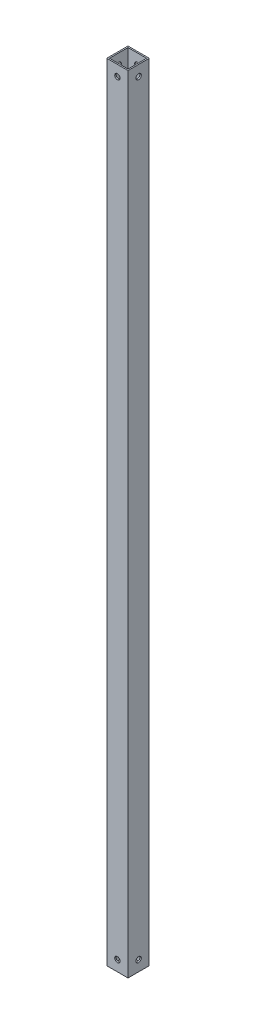
ISO-10303-21;
HEADER;
FILE_DESCRIPTION(('STEP AP214'),'2;1');
FILE_NAME('part.step','',(''),(''),'','','');
FILE_SCHEMA(('AUTOMOTIVE_DESIGN { 1 0 10303 214 1 1 1 1 }'));
ENDSEC;
DATA;
#1=APPLICATION_CONTEXT('core data for automotive mechanical design processes');
#2=APPLICATION_PROTOCOL_DEFINITION('international standard','automotive_design',2000,#1);
#3=PRODUCT_CONTEXT('',#1,'mechanical');
#4=PRODUCT('Part','Part','',(#3));
#5=PRODUCT_RELATED_PRODUCT_CATEGORY('part','',(#4));
#6=PRODUCT_DEFINITION_FORMATION('','',#4);
#7=PRODUCT_DEFINITION_CONTEXT('part definition',#1,'design');
#8=PRODUCT_DEFINITION('design','',#6,#7);
#9=PRODUCT_DEFINITION_SHAPE('','',#8);
#10=(LENGTH_UNIT() NAMED_UNIT(*) SI_UNIT(.MILLI.,.METRE.));
#11=(NAMED_UNIT(*) PLANE_ANGLE_UNIT() SI_UNIT($,.RADIAN.));
#12=(NAMED_UNIT(*) SI_UNIT($,.STERADIAN.) SOLID_ANGLE_UNIT());
#13=UNCERTAINTY_MEASURE_WITH_UNIT(LENGTH_MEASURE(1.E-05),#10,'distance_accuracy_value','');
#14=(GEOMETRIC_REPRESENTATION_CONTEXT(3) GLOBAL_UNCERTAINTY_ASSIGNED_CONTEXT((#13)) GLOBAL_UNIT_ASSIGNED_CONTEXT((#10,
#11,#12)) REPRESENTATION_CONTEXT('',''));
#15=CARTESIAN_POINT('',(0.,0.,0.));
#16=DIRECTION('',(0.,0.,1.));
#17=DIRECTION('',(1.,0.,0.));
#18=AXIS2_PLACEMENT_3D('',#15,#16,#17);
#19=CARTESIAN_POINT('',(0.,939.8,0.));
#20=DIRECTION('',(0.,1.,0.));
#21=DIRECTION('',(0.,0.,1.));
#22=AXIS2_PLACEMENT_3D('',#19,#20,#21);
#23=PLANE('',#22);
#24=DIRECTION('',(0.,0.,-1.));
#25=VECTOR('',#24,1.);
#26=CARTESIAN_POINT('',(12.7,939.8,-12.7));
#27=LINE('',#26,#25);
#28=CARTESIAN_POINT('',(12.7,939.8,12.7));
#29=VERTEX_POINT('',#28);
#30=CARTESIAN_POINT('',(12.7,939.8,-12.7));
#31=VERTEX_POINT('',#30);
#32=EDGE_CURVE('E157',#29,#31,#27,.T.);
#33=ORIENTED_EDGE('',*,*,#32,.T.);
#34=DIRECTION('',(-1.,0.,0.));
#35=VECTOR('',#34,1.);
#36=CARTESIAN_POINT('',(-12.7,939.8,-12.7));
#37=LINE('',#36,#35);
#38=CARTESIAN_POINT('',(-12.7,939.8,-12.7));
#39=VERTEX_POINT('',#38);
#40=EDGE_CURVE('E161',#31,#39,#37,.T.);
#41=ORIENTED_EDGE('',*,*,#40,.T.);
#42=DIRECTION('',(0.,0.,1.));
#43=VECTOR('',#42,1.);
#44=CARTESIAN_POINT('',(-12.7,939.8,-12.7));
#45=LINE('',#44,#43);
#46=CARTESIAN_POINT('',(-12.7,939.8,12.7));
#47=VERTEX_POINT('',#46);
#48=EDGE_CURVE('E165',#39,#47,#45,.T.);
#49=ORIENTED_EDGE('',*,*,#48,.T.);
#50=DIRECTION('',(1.,0.,0.));
#51=VECTOR('',#50,1.);
#52=CARTESIAN_POINT('',(-12.7,939.8,12.7));
#53=LINE('',#52,#51);
#54=EDGE_CURVE('E168',#47,#29,#53,.T.);
#55=ORIENTED_EDGE('',*,*,#54,.T.);
#56=EDGE_LOOP('',(#33,#41,#49,#55));
#57=FACE_BOUND('',#56,.T.);
#58=DIRECTION('',(1.,0.,0.));
#59=VECTOR('',#58,1.);
#60=CARTESIAN_POINT('',(-11.1125,939.8,11.1125));
#61=LINE('',#60,#59);
#62=CARTESIAN_POINT('',(-11.1125,939.8,11.1125));
#63=VERTEX_POINT('',#62);
#64=CARTESIAN_POINT('',(11.1125,939.8,11.1125));
#65=VERTEX_POINT('',#64);
#66=EDGE_CURVE('E116',#63,#65,#61,.T.);
#67=ORIENTED_EDGE('',*,*,#66,.F.);
#68=DIRECTION('',(0.,0.,1.));
#69=VECTOR('',#68,1.);
#70=CARTESIAN_POINT('',(-11.1125,939.8,-11.1125));
#71=LINE('',#70,#69);
#72=CARTESIAN_POINT('',(-11.1125,939.8,-11.1125));
#73=VERTEX_POINT('',#72);
#74=EDGE_CURVE('E107',#73,#63,#71,.T.);
#75=ORIENTED_EDGE('',*,*,#74,.F.);
#76=DIRECTION('',(-1.,0.,0.));
#77=VECTOR('',#76,1.);
#78=CARTESIAN_POINT('',(-11.1125,939.8,-11.1125));
#79=LINE('',#78,#77);
#80=CARTESIAN_POINT('',(11.1125,939.8,-11.1125));
#81=VERTEX_POINT('',#80);
#82=EDGE_CURVE('E133',#81,#73,#79,.T.);
#83=ORIENTED_EDGE('',*,*,#82,.F.);
#84=DIRECTION('',(0.,0.,-1.));
#85=VECTOR('',#84,1.);
#86=CARTESIAN_POINT('',(11.1125,939.8,-11.1125));
#87=LINE('',#86,#85);
#88=EDGE_CURVE('E129',#65,#81,#87,.T.);
#89=ORIENTED_EDGE('',*,*,#88,.F.);
#90=EDGE_LOOP('',(#67,#75,#83,#89));
#91=FACE_BOUND('',#90,.T.);
#92=ADVANCED_FACE('F39',(#57,#91),#23,.T.);
#93=CARTESIAN_POINT('',(0.,0.,0.));
#94=DIRECTION('',(0.,1.,0.));
#95=DIRECTION('',(0.,0.,1.));
#96=AXIS2_PLACEMENT_3D('',#93,#94,#95);
#97=PLANE('',#96);
#98=DIRECTION('',(0.,0.,-1.));
#99=VECTOR('',#98,1.);
#100=CARTESIAN_POINT('',(12.7,0.,-12.7));
#101=LINE('',#100,#99);
#102=CARTESIAN_POINT('',(12.7,0.,12.7));
#103=VERTEX_POINT('',#102);
#104=CARTESIAN_POINT('',(12.7,0.,-12.7));
#105=VERTEX_POINT('',#104);
#106=EDGE_CURVE('E125',#103,#105,#101,.T.);
#107=ORIENTED_EDGE('',*,*,#106,.F.);
#108=DIRECTION('',(1.,0.,0.));
#109=VECTOR('',#108,1.);
#110=CARTESIAN_POINT('',(-12.7,0.,12.7));
#111=LINE('',#110,#109);
#112=CARTESIAN_POINT('',(-12.7,0.,12.7));
#113=VERTEX_POINT('',#112);
#114=EDGE_CURVE('E162',#113,#103,#111,.T.);
#115=ORIENTED_EDGE('',*,*,#114,.F.);
#116=DIRECTION('',(0.,0.,1.));
#117=VECTOR('',#116,1.);
#118=CARTESIAN_POINT('',(-12.7,0.,-12.7));
#119=LINE('',#118,#117);
#120=CARTESIAN_POINT('',(-12.7,0.,-12.7));
#121=VERTEX_POINT('',#120);
#122=EDGE_CURVE('E178',#121,#113,#119,.T.);
#123=ORIENTED_EDGE('',*,*,#122,.F.);
#124=DIRECTION('',(-1.,0.,0.));
#125=VECTOR('',#124,1.);
#126=CARTESIAN_POINT('',(-12.7,0.,-12.7));
#127=LINE('',#126,#125);
#128=EDGE_CURVE('E175',#105,#121,#127,.T.);
#129=ORIENTED_EDGE('',*,*,#128,.F.);
#130=EDGE_LOOP('',(#107,#115,#123,#129));
#131=FACE_BOUND('',#130,.T.);
#132=DIRECTION('',(0.,0.,1.));
#133=VECTOR('',#132,1.);
#134=CARTESIAN_POINT('',(-11.1125,0.,-11.1125));
#135=LINE('',#134,#133);
#136=CARTESIAN_POINT('',(-11.1125,0.,-11.1125));
#137=VERTEX_POINT('',#136);
#138=CARTESIAN_POINT('',(-11.1125,0.,11.1125));
#139=VERTEX_POINT('',#138);
#140=EDGE_CURVE('E65',#137,#139,#135,.T.);
#141=ORIENTED_EDGE('',*,*,#140,.T.);
#142=DIRECTION('',(1.,0.,0.));
#143=VECTOR('',#142,1.);
#144=CARTESIAN_POINT('',(-11.1125,0.,11.1125));
#145=LINE('',#144,#143);
#146=CARTESIAN_POINT('',(11.1125,0.,11.1125));
#147=VERTEX_POINT('',#146);
#148=EDGE_CURVE('E123',#139,#147,#145,.T.);
#149=ORIENTED_EDGE('',*,*,#148,.T.);
#150=DIRECTION('',(0.,0.,-1.));
#151=VECTOR('',#150,1.);
#152=CARTESIAN_POINT('',(11.1125,0.,-11.1125));
#153=LINE('',#152,#151);
#154=CARTESIAN_POINT('',(11.1125,0.,-11.1125));
#155=VERTEX_POINT('',#154);
#156=EDGE_CURVE('E144',#147,#155,#153,.T.);
#157=ORIENTED_EDGE('',*,*,#156,.T.);
#158=DIRECTION('',(-1.,0.,0.));
#159=VECTOR('',#158,1.);
#160=CARTESIAN_POINT('',(-11.1125,0.,-11.1125));
#161=LINE('',#160,#159);
#162=EDGE_CURVE('E117',#155,#137,#161,.T.);
#163=ORIENTED_EDGE('',*,*,#162,.T.);
#164=EDGE_LOOP('',(#141,#149,#157,#163));
#165=FACE_BOUND('',#164,.T.);
#166=ADVANCED_FACE('F288',(#131,#165),#97,.F.);
#167=CARTESIAN_POINT('',(12.7,939.8,-12.7));
#168=DIRECTION('',(-1.,0.,0.));
#169=DIRECTION('',(0.,0.,1.));
#170=AXIS2_PLACEMENT_3D('',#167,#168,#169);
#171=PLANE('',#170);
#172=CARTESIAN_POINT('',(12.7,12.7,0.));
#173=DIRECTION('',(1.,0.,0.));
#174=DIRECTION('',(0.,0.,-1.));
#175=AXIS2_PLACEMENT_3D('',#172,#173,#174);
#176=CIRCLE('',#175,3.175);
#177=CARTESIAN_POINT('',(12.7,12.7,-3.175));
#178=VERTEX_POINT('',#177);
#179=EDGE_CURVE('E238',#178,#178,#176,.T.);
#180=ORIENTED_EDGE('',*,*,#179,.F.);
#181=EDGE_LOOP('',(#180));
#182=FACE_BOUND('',#181,.T.);
#183=CARTESIAN_POINT('',(12.7,927.1,0.));
#184=DIRECTION('',(1.,0.,0.));
#185=DIRECTION('',(0.,0.,-1.));
#186=AXIS2_PLACEMENT_3D('',#183,#184,#185);
#187=CIRCLE('',#186,3.175);
#188=CARTESIAN_POINT('',(12.7,927.1,-3.17499999999999));
#189=VERTEX_POINT('',#188);
#190=EDGE_CURVE('E234',#189,#189,#187,.T.);
#191=ORIENTED_EDGE('',*,*,#190,.F.);
#192=EDGE_LOOP('',(#191));
#193=FACE_BOUND('',#192,.T.);
#194=ORIENTED_EDGE('',*,*,#106,.T.);
#195=DIRECTION('',(0.,-1.,0.));
#196=VECTOR('',#195,1.);
#197=CARTESIAN_POINT('',(12.7,939.8,-12.7));
#198=LINE('',#197,#196);
#199=EDGE_CURVE('E11',#31,#105,#198,.T.);
#200=ORIENTED_EDGE('',*,*,#199,.F.);
#201=ORIENTED_EDGE('',*,*,#32,.F.);
#202=DIRECTION('',(0.,-1.,0.));
#203=VECTOR('',#202,1.);
#204=CARTESIAN_POINT('',(12.7,939.8,12.7));
#205=LINE('',#204,#203);
#206=EDGE_CURVE('E171',#29,#103,#205,.T.);
#207=ORIENTED_EDGE('',*,*,#206,.T.);
#208=EDGE_LOOP('',(#194,#200,#201,#207));
#209=FACE_BOUND('',#208,.T.);
#210=ADVANCED_FACE('F41',(#182,#193,#209),#171,.F.);
#211=CARTESIAN_POINT('',(-12.7,939.8,-12.7));
#212=DIRECTION('',(0.,0.,1.));
#213=DIRECTION('',(1.,0.,0.));
#214=AXIS2_PLACEMENT_3D('',#211,#212,#213);
#215=PLANE('',#214);
#216=CARTESIAN_POINT('',(0.,12.7,-12.7));
#217=DIRECTION('',(0.,0.,1.));
#218=DIRECTION('',(1.,0.,0.));
#219=AXIS2_PLACEMENT_3D('',#216,#217,#218);
#220=CIRCLE('',#219,3.175);
#221=CARTESIAN_POINT('',(3.175,12.7,-12.7));
#222=VERTEX_POINT('',#221);
#223=EDGE_CURVE('E206',#222,#222,#220,.T.);
#224=ORIENTED_EDGE('',*,*,#223,.T.);
#225=EDGE_LOOP('',(#224));
#226=FACE_BOUND('',#225,.T.);
#227=CARTESIAN_POINT('',(0.,927.1,-12.7));
#228=DIRECTION('',(0.,0.,1.));
#229=DIRECTION('',(1.,0.,0.));
#230=AXIS2_PLACEMENT_3D('',#227,#228,#229);
#231=CIRCLE('',#230,3.175);
#232=CARTESIAN_POINT('',(3.175,927.1,-12.7));
#233=VERTEX_POINT('',#232);
#234=EDGE_CURVE('E220',#233,#233,#231,.T.);
#235=ORIENTED_EDGE('',*,*,#234,.T.);
#236=EDGE_LOOP('',(#235));
#237=FACE_BOUND('',#236,.T.);
#238=ORIENTED_EDGE('',*,*,#128,.T.);
#239=DIRECTION('',(0.,-1.,0.));
#240=VECTOR('',#239,1.);
#241=CARTESIAN_POINT('',(-12.7,939.8,-12.7));
#242=LINE('',#241,#240);
#243=EDGE_CURVE('E49',#39,#121,#242,.T.);
#244=ORIENTED_EDGE('',*,*,#243,.F.);
#245=ORIENTED_EDGE('',*,*,#40,.F.);
#246=ORIENTED_EDGE('',*,*,#199,.T.);
#247=EDGE_LOOP('',(#238,#244,#245,#246));
#248=FACE_BOUND('',#247,.T.);
#249=ADVANCED_FACE('F275',(#226,#237,#248),#215,.F.);
#250=CARTESIAN_POINT('',(-12.7,939.8,-12.7));
#251=DIRECTION('',(1.,0.,0.));
#252=DIRECTION('',(0.,0.,-1.));
#253=AXIS2_PLACEMENT_3D('',#250,#251,#252);
#254=PLANE('',#253);
#255=CARTESIAN_POINT('',(-12.7,12.7,0.));
#256=DIRECTION('',(1.,0.,0.));
#257=DIRECTION('',(0.,0.,-1.));
#258=AXIS2_PLACEMENT_3D('',#255,#256,#257);
#259=CIRCLE('',#258,3.175);
#260=CARTESIAN_POINT('',(-12.7,12.7,-3.175));
#261=VERTEX_POINT('',#260);
#262=EDGE_CURVE('E198',#261,#261,#259,.T.);
#263=ORIENTED_EDGE('',*,*,#262,.T.);
#264=EDGE_LOOP('',(#263));
#265=FACE_BOUND('',#264,.T.);
#266=CARTESIAN_POINT('',(-12.7,927.1,0.));
#267=DIRECTION('',(1.,0.,0.));
#268=DIRECTION('',(0.,0.,-1.));
#269=AXIS2_PLACEMENT_3D('',#266,#267,#268);
#270=CIRCLE('',#269,3.175);
#271=CARTESIAN_POINT('',(-12.7,927.1,-3.17499999999999));
#272=VERTEX_POINT('',#271);
#273=EDGE_CURVE('E242',#272,#272,#270,.T.);
#274=ORIENTED_EDGE('',*,*,#273,.T.);
#275=EDGE_LOOP('',(#274));
#276=FACE_BOUND('',#275,.T.);
#277=ORIENTED_EDGE('',*,*,#122,.T.);
#278=DIRECTION('',(0.,-1.,0.));
#279=VECTOR('',#278,1.);
#280=CARTESIAN_POINT('',(-12.7,939.8,12.7));
#281=LINE('',#280,#279);
#282=EDGE_CURVE('E186',#47,#113,#281,.T.);
#283=ORIENTED_EDGE('',*,*,#282,.F.);
#284=ORIENTED_EDGE('',*,*,#48,.F.);
#285=ORIENTED_EDGE('',*,*,#243,.T.);
#286=EDGE_LOOP('',(#277,#283,#284,#285));
#287=FACE_BOUND('',#286,.T.);
#288=ADVANCED_FACE('F272',(#265,#276,#287),#254,.F.);
#289=CARTESIAN_POINT('',(-12.7,939.8,12.7));
#290=DIRECTION('',(0.,0.,-1.));
#291=DIRECTION('',(-1.,0.,0.));
#292=AXIS2_PLACEMENT_3D('',#289,#290,#291);
#293=PLANE('',#292);
#294=CARTESIAN_POINT('',(0.,12.7,12.7));
#295=DIRECTION('',(0.,0.,1.));
#296=DIRECTION('',(1.,0.,0.));
#297=AXIS2_PLACEMENT_3D('',#294,#295,#296);
#298=CIRCLE('',#297,3.175);
#299=CARTESIAN_POINT('',(3.175,12.7,12.7));
#300=VERTEX_POINT('',#299);
#301=EDGE_CURVE('E214',#300,#300,#298,.T.);
#302=ORIENTED_EDGE('',*,*,#301,.F.);
#303=EDGE_LOOP('',(#302));
#304=FACE_BOUND('',#303,.T.);
#305=CARTESIAN_POINT('',(0.,927.1,12.7));
#306=DIRECTION('',(0.,0.,1.));
#307=DIRECTION('',(1.,0.,0.));
#308=AXIS2_PLACEMENT_3D('',#305,#306,#307);
#309=CIRCLE('',#308,3.175);
#310=CARTESIAN_POINT('',(3.175,927.1,12.7));
#311=VERTEX_POINT('',#310);
#312=EDGE_CURVE('E226',#311,#311,#309,.T.);
#313=ORIENTED_EDGE('',*,*,#312,.F.);
#314=EDGE_LOOP('',(#313));
#315=FACE_BOUND('',#314,.T.);
#316=ORIENTED_EDGE('',*,*,#114,.T.);
#317=ORIENTED_EDGE('',*,*,#206,.F.);
#318=ORIENTED_EDGE('',*,*,#54,.F.);
#319=ORIENTED_EDGE('',*,*,#282,.T.);
#320=EDGE_LOOP('',(#316,#317,#318,#319));
#321=FACE_BOUND('',#320,.T.);
#322=ADVANCED_FACE('F260',(#304,#315,#321),#293,.F.);
#323=CARTESIAN_POINT('',(-11.1125,939.8,-11.1125));
#324=DIRECTION('',(1.,0.,0.));
#325=DIRECTION('',(0.,0.,-1.));
#326=AXIS2_PLACEMENT_3D('',#323,#324,#325);
#327=PLANE('',#326);
#328=CARTESIAN_POINT('',(-11.1125,12.7,0.));
#329=DIRECTION('',(1.,0.,0.));
#330=DIRECTION('',(0.,0.,-1.));
#331=AXIS2_PLACEMENT_3D('',#328,#329,#330);
#332=CIRCLE('',#331,3.175);
#333=CARTESIAN_POINT('',(-11.1125,12.7,-3.175));
#334=VERTEX_POINT('',#333);
#335=EDGE_CURVE('E141',#334,#334,#332,.T.);
#336=ORIENTED_EDGE('',*,*,#335,.F.);
#337=EDGE_LOOP('',(#336));
#338=FACE_BOUND('',#337,.T.);
#339=CARTESIAN_POINT('',(-11.1125,927.1,0.));
#340=DIRECTION('',(1.,0.,0.));
#341=DIRECTION('',(0.,0.,-1.));
#342=AXIS2_PLACEMENT_3D('',#339,#340,#341);
#343=CIRCLE('',#342,3.175);
#344=CARTESIAN_POINT('',(-11.1125,927.1,-3.17499999999999));
#345=VERTEX_POINT('',#344);
#346=EDGE_CURVE('E197',#345,#345,#343,.T.);
#347=ORIENTED_EDGE('',*,*,#346,.F.);
#348=EDGE_LOOP('',(#347));
#349=FACE_BOUND('',#348,.T.);
#350=ORIENTED_EDGE('',*,*,#140,.F.);
#351=DIRECTION('',(0.,-1.,0.));
#352=VECTOR('',#351,1.);
#353=CARTESIAN_POINT('',(-11.1125,939.8,-11.1125));
#354=LINE('',#353,#352);
#355=EDGE_CURVE('E111',#73,#137,#354,.T.);
#356=ORIENTED_EDGE('',*,*,#355,.F.);
#357=ORIENTED_EDGE('',*,*,#74,.T.);
#358=DIRECTION('',(0.,-1.,0.));
#359=VECTOR('',#358,1.);
#360=CARTESIAN_POINT('',(-11.1125,939.8,11.1125));
#361=LINE('',#360,#359);
#362=EDGE_CURVE('E110',#63,#139,#361,.T.);
#363=ORIENTED_EDGE('',*,*,#362,.T.);
#364=EDGE_LOOP('',(#350,#356,#357,#363));
#365=FACE_BOUND('',#364,.T.);
#366=ADVANCED_FACE('F109',(#338,#349,#365),#327,.T.);
#367=CARTESIAN_POINT('',(-11.1125,939.8,11.1125));
#368=DIRECTION('',(0.,0.,-1.));
#369=DIRECTION('',(-1.,0.,0.));
#370=AXIS2_PLACEMENT_3D('',#367,#368,#369);
#371=PLANE('',#370);
#372=CARTESIAN_POINT('',(0.,12.7,11.1125));
#373=DIRECTION('',(0.,0.,-1.));
#374=DIRECTION('',(-1.,0.,0.));
#375=AXIS2_PLACEMENT_3D('',#372,#373,#374);
#376=CIRCLE('',#375,3.175);
#377=CARTESIAN_POINT('',(-3.175,12.7,11.1125));
#378=VERTEX_POINT('',#377);
#379=EDGE_CURVE('E230',#378,#378,#376,.T.);
#380=ORIENTED_EDGE('',*,*,#379,.F.);
#381=EDGE_LOOP('',(#380));
#382=FACE_BOUND('',#381,.T.);
#383=CARTESIAN_POINT('',(0.,927.1,11.1125));
#384=DIRECTION('',(0.,0.,-1.));
#385=DIRECTION('',(-1.,0.,0.));
#386=AXIS2_PLACEMENT_3D('',#383,#384,#385);
#387=CIRCLE('',#386,3.175);
#388=CARTESIAN_POINT('',(-3.175,927.1,11.1125));
#389=VERTEX_POINT('',#388);
#390=EDGE_CURVE('E205',#389,#389,#387,.T.);
#391=ORIENTED_EDGE('',*,*,#390,.F.);
#392=EDGE_LOOP('',(#391));
#393=FACE_BOUND('',#392,.T.);
#394=ORIENTED_EDGE('',*,*,#148,.F.);
#395=ORIENTED_EDGE('',*,*,#362,.F.);
#396=ORIENTED_EDGE('',*,*,#66,.T.);
#397=DIRECTION('',(0.,-1.,0.));
#398=VECTOR('',#397,1.);
#399=CARTESIAN_POINT('',(11.1125,939.8,11.1125));
#400=LINE('',#399,#398);
#401=EDGE_CURVE('E126',#65,#147,#400,.T.);
#402=ORIENTED_EDGE('',*,*,#401,.T.);
#403=EDGE_LOOP('',(#394,#395,#396,#402));
#404=FACE_BOUND('',#403,.T.);
#405=ADVANCED_FACE('F120',(#382,#393,#404),#371,.T.);
#406=CARTESIAN_POINT('',(11.1125,939.8,-11.1125));
#407=DIRECTION('',(-1.,0.,0.));
#408=DIRECTION('',(0.,0.,1.));
#409=AXIS2_PLACEMENT_3D('',#406,#407,#408);
#410=PLANE('',#409);
#411=CARTESIAN_POINT('',(11.1125,12.7,0.));
#412=DIRECTION('',(-1.,0.,0.));
#413=DIRECTION('',(0.,0.,1.));
#414=AXIS2_PLACEMENT_3D('',#411,#412,#413);
#415=CIRCLE('',#414,3.175);
#416=CARTESIAN_POINT('',(11.1125,12.7,3.175));
#417=VERTEX_POINT('',#416);
#418=EDGE_CURVE('E199',#417,#417,#415,.T.);
#419=ORIENTED_EDGE('',*,*,#418,.F.);
#420=EDGE_LOOP('',(#419));
#421=FACE_BOUND('',#420,.T.);
#422=CARTESIAN_POINT('',(11.1125,927.1,0.));
#423=DIRECTION('',(-1.,0.,0.));
#424=DIRECTION('',(0.,0.,1.));
#425=AXIS2_PLACEMENT_3D('',#422,#423,#424);
#426=CIRCLE('',#425,3.175);
#427=CARTESIAN_POINT('',(11.1125,927.1,3.175));
#428=VERTEX_POINT('',#427);
#429=EDGE_CURVE('E193',#428,#428,#426,.T.);
#430=ORIENTED_EDGE('',*,*,#429,.F.);
#431=EDGE_LOOP('',(#430));
#432=FACE_BOUND('',#431,.T.);
#433=ORIENTED_EDGE('',*,*,#156,.F.);
#434=ORIENTED_EDGE('',*,*,#401,.F.);
#435=ORIENTED_EDGE('',*,*,#88,.T.);
#436=DIRECTION('',(0.,-1.,0.));
#437=VECTOR('',#436,1.);
#438=CARTESIAN_POINT('',(11.1125,939.8,-11.1125));
#439=LINE('',#438,#437);
#440=EDGE_CURVE('E57',#81,#155,#439,.T.);
#441=ORIENTED_EDGE('',*,*,#440,.T.);
#442=EDGE_LOOP('',(#433,#434,#435,#441));
#443=FACE_BOUND('',#442,.T.);
#444=ADVANCED_FACE('F354',(#421,#432,#443),#410,.T.);
#445=CARTESIAN_POINT('',(-11.1125,939.8,-11.1125));
#446=DIRECTION('',(0.,0.,1.));
#447=DIRECTION('',(1.,0.,0.));
#448=AXIS2_PLACEMENT_3D('',#445,#446,#447);
#449=PLANE('',#448);
#450=CARTESIAN_POINT('',(0.,12.7,-11.1125));
#451=DIRECTION('',(0.,0.,1.));
#452=DIRECTION('',(1.,0.,0.));
#453=AXIS2_PLACEMENT_3D('',#450,#451,#452);
#454=CIRCLE('',#453,3.175);
#455=CARTESIAN_POINT('',(3.175,12.7,-11.1125));
#456=VERTEX_POINT('',#455);
#457=EDGE_CURVE('E43',#456,#456,#454,.T.);
#458=ORIENTED_EDGE('',*,*,#457,.F.);
#459=EDGE_LOOP('',(#458));
#460=FACE_BOUND('',#459,.T.);
#461=CARTESIAN_POINT('',(0.,927.1,-11.1125));
#462=DIRECTION('',(0.,0.,1.));
#463=DIRECTION('',(1.,0.,0.));
#464=AXIS2_PLACEMENT_3D('',#461,#462,#463);
#465=CIRCLE('',#464,3.175);
#466=CARTESIAN_POINT('',(3.175,927.1,-11.1125));
#467=VERTEX_POINT('',#466);
#468=EDGE_CURVE('E202',#467,#467,#465,.T.);
#469=ORIENTED_EDGE('',*,*,#468,.F.);
#470=EDGE_LOOP('',(#469));
#471=FACE_BOUND('',#470,.T.);
#472=ORIENTED_EDGE('',*,*,#162,.F.);
#473=ORIENTED_EDGE('',*,*,#440,.F.);
#474=ORIENTED_EDGE('',*,*,#82,.T.);
#475=ORIENTED_EDGE('',*,*,#355,.T.);
#476=EDGE_LOOP('',(#472,#473,#474,#475));
#477=FACE_BOUND('',#476,.T.);
#478=ADVANCED_FACE('F345',(#460,#471,#477),#449,.T.);
#479=CARTESIAN_POINT('',(-12.7,927.1,0.));
#480=DIRECTION('',(1.,0.,0.));
#481=DIRECTION('',(0.,0.,-1.));
#482=AXIS2_PLACEMENT_3D('',#479,#480,#481);
#483=CYLINDRICAL_SURFACE('',#482,3.175);
#484=ORIENTED_EDGE('',*,*,#429,.T.);
#485=EDGE_LOOP('',(#484));
#486=FACE_BOUND('',#485,.T.);
#487=ORIENTED_EDGE('',*,*,#190,.T.);
#488=EDGE_LOOP('',(#487));
#489=FACE_BOUND('',#488,.T.);
#490=ADVANCED_FACE('F269',(#486,#489),#483,.F.);
#491=CARTESIAN_POINT('',(-12.7,12.7,0.));
#492=DIRECTION('',(1.,0.,0.));
#493=DIRECTION('',(0.,0.,-1.));
#494=AXIS2_PLACEMENT_3D('',#491,#492,#493);
#495=CYLINDRICAL_SURFACE('',#494,3.175);
#496=ORIENTED_EDGE('',*,*,#418,.T.);
#497=EDGE_LOOP('',(#496));
#498=FACE_BOUND('',#497,.T.);
#499=ORIENTED_EDGE('',*,*,#179,.T.);
#500=EDGE_LOOP('',(#499));
#501=FACE_BOUND('',#500,.T.);
#502=ADVANCED_FACE('F267',(#498,#501),#495,.F.);
#503=ORIENTED_EDGE('',*,*,#346,.T.);
#504=EDGE_LOOP('',(#503));
#505=FACE_BOUND('',#504,.T.);
#506=ORIENTED_EDGE('',*,*,#273,.F.);
#507=EDGE_LOOP('',(#506));
#508=FACE_BOUND('',#507,.T.);
#509=ADVANCED_FACE('F264',(#505,#508),#483,.F.);
#510=ORIENTED_EDGE('',*,*,#335,.T.);
#511=EDGE_LOOP('',(#510));
#512=FACE_BOUND('',#511,.T.);
#513=ORIENTED_EDGE('',*,*,#262,.F.);
#514=EDGE_LOOP('',(#513));
#515=FACE_BOUND('',#514,.T.);
#516=ADVANCED_FACE('F255',(#512,#515),#495,.F.);
#517=CARTESIAN_POINT('',(0.,927.1,-12.7));
#518=DIRECTION('',(0.,0.,1.));
#519=DIRECTION('',(1.,0.,0.));
#520=AXIS2_PLACEMENT_3D('',#517,#518,#519);
#521=CYLINDRICAL_SURFACE('',#520,3.175);
#522=ORIENTED_EDGE('',*,*,#468,.T.);
#523=EDGE_LOOP('',(#522));
#524=FACE_BOUND('',#523,.T.);
#525=ORIENTED_EDGE('',*,*,#234,.F.);
#526=EDGE_LOOP('',(#525));
#527=FACE_BOUND('',#526,.T.);
#528=ADVANCED_FACE('F323',(#524,#527),#521,.F.);
#529=CARTESIAN_POINT('',(0.,12.7,-12.7));
#530=DIRECTION('',(0.,0.,1.));
#531=DIRECTION('',(1.,0.,0.));
#532=AXIS2_PLACEMENT_3D('',#529,#530,#531);
#533=CYLINDRICAL_SURFACE('',#532,3.175);
#534=ORIENTED_EDGE('',*,*,#457,.T.);
#535=EDGE_LOOP('',(#534));
#536=FACE_BOUND('',#535,.T.);
#537=ORIENTED_EDGE('',*,*,#223,.F.);
#538=EDGE_LOOP('',(#537));
#539=FACE_BOUND('',#538,.T.);
#540=ADVANCED_FACE('F320',(#536,#539),#533,.F.);
#541=ORIENTED_EDGE('',*,*,#390,.T.);
#542=EDGE_LOOP('',(#541));
#543=FACE_BOUND('',#542,.T.);
#544=ORIENTED_EDGE('',*,*,#312,.T.);
#545=EDGE_LOOP('',(#544));
#546=FACE_BOUND('',#545,.T.);
#547=ADVANCED_FACE('F317',(#543,#546),#521,.F.);
#548=ORIENTED_EDGE('',*,*,#379,.T.);
#549=EDGE_LOOP('',(#548));
#550=FACE_BOUND('',#549,.T.);
#551=ORIENTED_EDGE('',*,*,#301,.T.);
#552=EDGE_LOOP('',(#551));
#553=FACE_BOUND('',#552,.T.);
#554=ADVANCED_FACE('F319',(#550,#553),#533,.F.);
#555=CLOSED_SHELL('',(#92,#166,#210,#249,#288,#322,#366,#405,#444,#478,#490,#502,#509,#516,#528,
#540,#547,#554));
#556=MANIFOLD_SOLID_BREP('B2',#555);
#557=ADVANCED_BREP_SHAPE_REPRESENTATION('',(#18,#556),#14);
#558=SHAPE_DEFINITION_REPRESENTATION(#9,#557);
ENDSEC;
END-ISO-10303-21;
